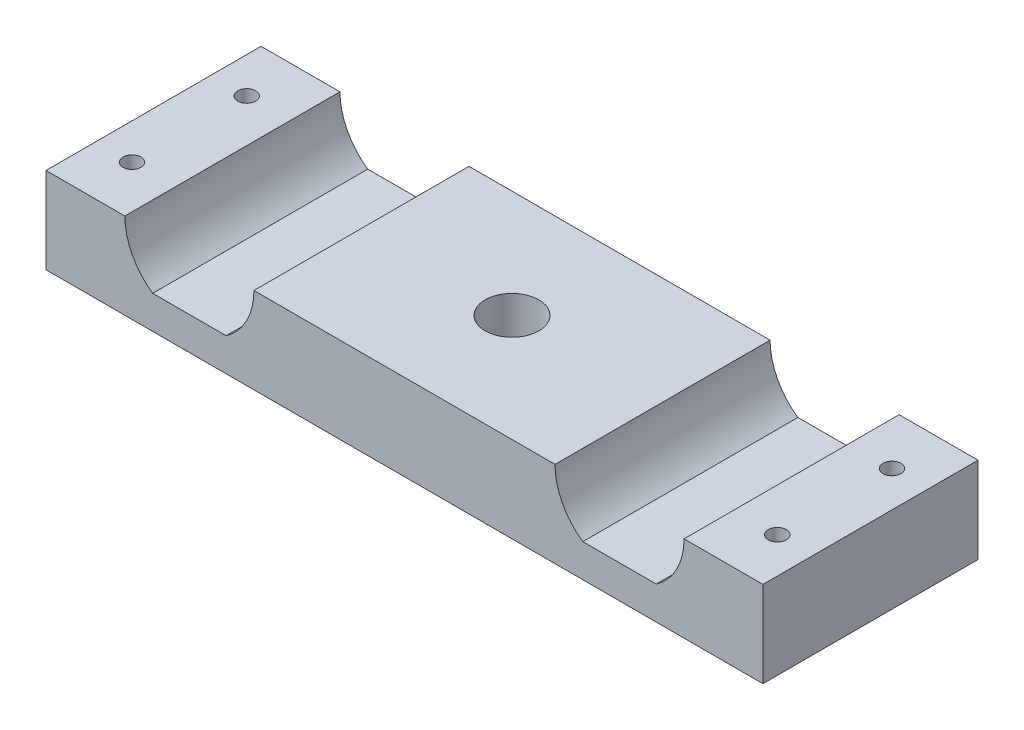
ISO-10303-21;
HEADER;
FILE_DESCRIPTION(('STEP AP214'),'2;1');
FILE_NAME('part.step','',(''),(''),'','','');
FILE_SCHEMA(('AUTOMOTIVE_DESIGN { 1 0 10303 214 1 1 1 1 }'));
ENDSEC;
DATA;
#1=APPLICATION_CONTEXT('core data for automotive mechanical design processes');
#2=APPLICATION_PROTOCOL_DEFINITION('international standard','automotive_design',2000,#1);
#3=PRODUCT_CONTEXT('',#1,'mechanical');
#4=PRODUCT('Part','Part','',(#3));
#5=PRODUCT_RELATED_PRODUCT_CATEGORY('part','',(#4));
#6=PRODUCT_DEFINITION_FORMATION('','',#4);
#7=PRODUCT_DEFINITION_CONTEXT('part definition',#1,'design');
#8=PRODUCT_DEFINITION('design','',#6,#7);
#9=PRODUCT_DEFINITION_SHAPE('','',#8);
#10=(LENGTH_UNIT() NAMED_UNIT(*) SI_UNIT(.MILLI.,.METRE.));
#11=(NAMED_UNIT(*) PLANE_ANGLE_UNIT() SI_UNIT($,.RADIAN.));
#12=(NAMED_UNIT(*) SI_UNIT($,.STERADIAN.) SOLID_ANGLE_UNIT());
#13=UNCERTAINTY_MEASURE_WITH_UNIT(LENGTH_MEASURE(1.E-05),#10,'distance_accuracy_value','');
#14=(GEOMETRIC_REPRESENTATION_CONTEXT(3) GLOBAL_UNCERTAINTY_ASSIGNED_CONTEXT((#13)) GLOBAL_UNIT_ASSIGNED_CONTEXT((#10,
#11,#12)) REPRESENTATION_CONTEXT('',''));
#15=CARTESIAN_POINT('',(0.,0.,0.));
#16=DIRECTION('',(0.,0.,1.));
#17=DIRECTION('',(1.,0.,0.));
#18=AXIS2_PLACEMENT_3D('',#15,#16,#17);
#19=CARTESIAN_POINT('',(63.5,0.,38.1));
#20=DIRECTION('',(-1.,0.,0.));
#21=DIRECTION('',(0.,0.,1.));
#22=AXIS2_PLACEMENT_3D('',#19,#20,#21);
#23=PLANE('',#22);
#24=DIRECTION('',(0.,1.,0.));
#25=VECTOR('',#24,1.);
#26=CARTESIAN_POINT('',(63.5,0.,0.));
#27=LINE('',#26,#25);
#28=CARTESIAN_POINT('',(63.5,0.,0.));
#29=VERTEX_POINT('',#28);
#30=CARTESIAN_POINT('',(63.5,15.24,0.));
#31=VERTEX_POINT('',#30);
#32=EDGE_CURVE('E166',#29,#31,#27,.T.);
#33=ORIENTED_EDGE('',*,*,#32,.T.);
#34=DIRECTION('',(0.,0.,-1.));
#35=VECTOR('',#34,1.);
#36=CARTESIAN_POINT('',(63.5,15.24,38.1));
#37=LINE('',#36,#35);
#38=CARTESIAN_POINT('',(63.5,15.24,38.1));
#39=VERTEX_POINT('',#38);
#40=EDGE_CURVE('E11',#39,#31,#37,.T.);
#41=ORIENTED_EDGE('',*,*,#40,.F.);
#42=DIRECTION('',(0.,1.,0.));
#43=VECTOR('',#42,1.);
#44=CARTESIAN_POINT('',(63.5,0.,38.1));
#45=LINE('',#44,#43);
#46=CARTESIAN_POINT('',(63.5,0.,38.1));
#47=VERTEX_POINT('',#46);
#48=EDGE_CURVE('E201',#47,#39,#45,.T.);
#49=ORIENTED_EDGE('',*,*,#48,.F.);
#50=DIRECTION('',(0.,0.,-1.));
#51=VECTOR('',#50,1.);
#52=CARTESIAN_POINT('',(63.5,0.,38.1));
#53=LINE('',#52,#51);
#54=EDGE_CURVE('E162',#47,#29,#53,.T.);
#55=ORIENTED_EDGE('',*,*,#54,.T.);
#56=EDGE_LOOP('',(#33,#41,#49,#55));
#57=FACE_BOUND('',#56,.T.);
#58=ADVANCED_FACE('F39',(#57),#23,.F.);
#59=CARTESIAN_POINT('',(63.5,15.24,38.1));
#60=DIRECTION('',(0.,-1.,0.));
#61=DIRECTION('',(0.,0.,-1.));
#62=AXIS2_PLACEMENT_3D('',#59,#60,#61);
#63=PLANE('',#62);
#64=CARTESIAN_POINT('',(57.15,15.24,29.21));
#65=DIRECTION('',(0.,1.,0.));
#66=DIRECTION('',(0.,0.,1.));
#67=AXIS2_PLACEMENT_3D('',#64,#65,#66);
#68=CIRCLE('',#67,1.58750000000001);
#69=CARTESIAN_POINT('',(57.15,15.24,30.7975));
#70=VERTEX_POINT('',#69);
#71=EDGE_CURVE('E261',#70,#70,#68,.T.);
#72=ORIENTED_EDGE('',*,*,#71,.F.);
#73=EDGE_LOOP('',(#72));
#74=FACE_BOUND('',#73,.T.);
#75=CARTESIAN_POINT('',(57.15,15.24,8.89));
#76=DIRECTION('',(0.,1.,0.));
#77=DIRECTION('',(0.,0.,1.));
#78=AXIS2_PLACEMENT_3D('',#75,#76,#77);
#79=CIRCLE('',#78,1.58750000000001);
#80=CARTESIAN_POINT('',(57.15,15.24,10.4775));
#81=VERTEX_POINT('',#80);
#82=EDGE_CURVE('E244',#81,#81,#79,.T.);
#83=ORIENTED_EDGE('',*,*,#82,.F.);
#84=EDGE_LOOP('',(#83));
#85=FACE_BOUND('',#84,.T.);
#86=DIRECTION('',(-1.,0.,0.));
#87=VECTOR('',#86,1.);
#88=CARTESIAN_POINT('',(63.5,15.24,0.));
#89=LINE('',#88,#87);
#90=CARTESIAN_POINT('',(49.53,15.24,0.));
#91=VERTEX_POINT('',#90);
#92=EDGE_CURVE('E170',#31,#91,#89,.T.);
#93=ORIENTED_EDGE('',*,*,#92,.T.);
#94=DIRECTION('',(0.,0.,-1.));
#95=VECTOR('',#94,1.);
#96=CARTESIAN_POINT('',(49.53,15.24,38.1));
#97=LINE('',#96,#95);
#98=CARTESIAN_POINT('',(49.53,15.24,38.1));
#99=VERTEX_POINT('',#98);
#100=EDGE_CURVE('E49',#99,#91,#97,.T.);
#101=ORIENTED_EDGE('',*,*,#100,.F.);
#102=DIRECTION('',(-1.,0.,0.));
#103=VECTOR('',#102,1.);
#104=CARTESIAN_POINT('',(63.5,15.24,38.1));
#105=LINE('',#104,#103);
#106=EDGE_CURVE('E113',#39,#99,#105,.T.);
#107=ORIENTED_EDGE('',*,*,#106,.F.);
#108=ORIENTED_EDGE('',*,*,#40,.T.);
#109=EDGE_LOOP('',(#93,#101,#107,#108));
#110=FACE_BOUND('',#109,.T.);
#111=ADVANCED_FACE('F324',(#74,#85,#110),#63,.F.);
#112=CARTESIAN_POINT('',(38.1,15.24,38.1));
#113=DIRECTION('',(0.,0.,-1.));
#114=DIRECTION('',(-1.,0.,0.));
#115=AXIS2_PLACEMENT_3D('',#112,#113,#114);
#116=CYLINDRICAL_SURFACE('',#115,11.43);
#117=CARTESIAN_POINT('',(38.1,15.24,0.));
#118=DIRECTION('',(0.,0.,-1.));
#119=DIRECTION('',(1.,0.,0.));
#120=AXIS2_PLACEMENT_3D('',#117,#118,#119);
#121=CIRCLE('',#120,11.43);
#122=CARTESIAN_POINT('',(44.6055742252318,5.842,0.));
#123=VERTEX_POINT('',#122);
#124=EDGE_CURVE('E174',#91,#123,#121,.T.);
#125=ORIENTED_EDGE('',*,*,#124,.T.);
#126=DIRECTION('',(0.,0.,-1.));
#127=VECTOR('',#126,1.);
#128=CARTESIAN_POINT('',(44.6055742252318,5.842,38.1));
#129=LINE('',#128,#127);
#130=CARTESIAN_POINT('',(44.6055742252318,5.842,38.1));
#131=VERTEX_POINT('',#130);
#132=EDGE_CURVE('E228',#131,#123,#129,.T.);
#133=ORIENTED_EDGE('',*,*,#132,.F.);
#134=CARTESIAN_POINT('',(38.1,15.24,38.1));
#135=DIRECTION('',(0.,0.,-1.));
#136=DIRECTION('',(1.,0.,0.));
#137=AXIS2_PLACEMENT_3D('',#134,#135,#136);
#138=CIRCLE('',#137,11.43);
#139=EDGE_CURVE('E277',#99,#131,#138,.T.);
#140=ORIENTED_EDGE('',*,*,#139,.F.);
#141=ORIENTED_EDGE('',*,*,#100,.T.);
#142=EDGE_LOOP('',(#125,#133,#140,#141));
#143=FACE_BOUND('',#142,.T.);
#144=ADVANCED_FACE('F328',(#143),#116,.F.);
#145=CARTESIAN_POINT('',(44.6055742252318,5.842,38.1));
#146=DIRECTION('',(0.,-1.,0.));
#147=DIRECTION('',(0.,0.,-1.));
#148=AXIS2_PLACEMENT_3D('',#145,#146,#147);
#149=PLANE('',#148);
#150=DIRECTION('',(-1.,0.,0.));
#151=VECTOR('',#150,1.);
#152=CARTESIAN_POINT('',(44.6055742252318,5.842,0.));
#153=LINE('',#152,#151);
#154=CARTESIAN_POINT('',(31.5944257747682,5.842,0.));
#155=VERTEX_POINT('',#154);
#156=EDGE_CURVE('E177',#123,#155,#153,.T.);
#157=ORIENTED_EDGE('',*,*,#156,.T.);
#158=DIRECTION('',(0.,0.,-1.));
#159=VECTOR('',#158,1.);
#160=CARTESIAN_POINT('',(31.5944257747682,5.842,38.1));
#161=LINE('',#160,#159);
#162=CARTESIAN_POINT('',(31.5944257747682,5.842,38.1));
#163=VERTEX_POINT('',#162);
#164=EDGE_CURVE('E224',#163,#155,#161,.T.);
#165=ORIENTED_EDGE('',*,*,#164,.F.);
#166=DIRECTION('',(-1.,0.,0.));
#167=VECTOR('',#166,1.);
#168=CARTESIAN_POINT('',(44.6055742252318,5.842,38.1));
#169=LINE('',#168,#167);
#170=EDGE_CURVE('E280',#131,#163,#169,.T.);
#171=ORIENTED_EDGE('',*,*,#170,.F.);
#172=ORIENTED_EDGE('',*,*,#132,.T.);
#173=EDGE_LOOP('',(#157,#165,#171,#172));
#174=FACE_BOUND('',#173,.T.);
#175=ADVANCED_FACE('F333',(#174),#149,.F.);
#176=CARTESIAN_POINT('',(38.1,15.24,38.1));
#177=DIRECTION('',(0.,0.,-1.));
#178=DIRECTION('',(-1.,0.,0.));
#179=AXIS2_PLACEMENT_3D('',#176,#177,#178);
#180=CYLINDRICAL_SURFACE('',#179,11.43);
#181=CARTESIAN_POINT('',(38.1,15.24,0.));
#182=DIRECTION('',(0.,0.,-1.));
#183=DIRECTION('',(1.,0.,0.));
#184=AXIS2_PLACEMENT_3D('',#181,#182,#183);
#185=CIRCLE('',#184,11.43);
#186=CARTESIAN_POINT('',(26.67,15.24,0.));
#187=VERTEX_POINT('',#186);
#188=EDGE_CURVE('E180',#155,#187,#185,.T.);
#189=ORIENTED_EDGE('',*,*,#188,.T.);
#190=DIRECTION('',(0.,0.,-1.));
#191=VECTOR('',#190,1.);
#192=CARTESIAN_POINT('',(26.67,15.24,38.1));
#193=LINE('',#192,#191);
#194=CARTESIAN_POINT('',(26.67,15.24,38.1));
#195=VERTEX_POINT('',#194);
#196=EDGE_CURVE('E220',#195,#187,#193,.T.);
#197=ORIENTED_EDGE('',*,*,#196,.F.);
#198=CARTESIAN_POINT('',(38.1,15.24,38.1));
#199=DIRECTION('',(0.,0.,-1.));
#200=DIRECTION('',(1.,0.,0.));
#201=AXIS2_PLACEMENT_3D('',#198,#199,#200);
#202=CIRCLE('',#201,11.43);
#203=EDGE_CURVE('E283',#163,#195,#202,.T.);
#204=ORIENTED_EDGE('',*,*,#203,.F.);
#205=ORIENTED_EDGE('',*,*,#164,.T.);
#206=EDGE_LOOP('',(#189,#197,#204,#205));
#207=FACE_BOUND('',#206,.T.);
#208=ADVANCED_FACE('F341',(#207),#180,.F.);
#209=CARTESIAN_POINT('',(26.67,15.24,38.1));
#210=DIRECTION('',(0.,-1.,0.));
#211=DIRECTION('',(0.,0.,-1.));
#212=AXIS2_PLACEMENT_3D('',#209,#210,#211);
#213=PLANE('',#212);
#214=CARTESIAN_POINT('',(0.,15.24,19.05));
#215=DIRECTION('',(0.,1.,0.));
#216=DIRECTION('',(0.,0.,1.));
#217=AXIS2_PLACEMENT_3D('',#214,#215,#216);
#218=CIRCLE('',#217,4.76250000000001);
#219=CARTESIAN_POINT('',(0.,15.24,23.8125));
#220=VERTEX_POINT('',#219);
#221=EDGE_CURVE('E239',#220,#220,#218,.T.);
#222=ORIENTED_EDGE('',*,*,#221,.F.);
#223=EDGE_LOOP('',(#222));
#224=FACE_BOUND('',#223,.T.);
#225=DIRECTION('',(-1.,0.,0.));
#226=VECTOR('',#225,1.);
#227=CARTESIAN_POINT('',(26.67,15.24,0.));
#228=LINE('',#227,#226);
#229=CARTESIAN_POINT('',(-26.67,15.24,0.));
#230=VERTEX_POINT('',#229);
#231=EDGE_CURVE('E183',#187,#230,#228,.T.);
#232=ORIENTED_EDGE('',*,*,#231,.T.);
#233=DIRECTION('',(0.,0.,-1.));
#234=VECTOR('',#233,1.);
#235=CARTESIAN_POINT('',(-26.67,15.24,38.1));
#236=LINE('',#235,#234);
#237=CARTESIAN_POINT('',(-26.67,15.24,38.1));
#238=VERTEX_POINT('',#237);
#239=EDGE_CURVE('E216',#238,#230,#236,.T.);
#240=ORIENTED_EDGE('',*,*,#239,.F.);
#241=DIRECTION('',(-1.,0.,0.));
#242=VECTOR('',#241,1.);
#243=CARTESIAN_POINT('',(26.67,15.24,38.1));
#244=LINE('',#243,#242);
#245=EDGE_CURVE('E286',#195,#238,#244,.T.);
#246=ORIENTED_EDGE('',*,*,#245,.F.);
#247=ORIENTED_EDGE('',*,*,#196,.T.);
#248=EDGE_LOOP('',(#232,#240,#246,#247));
#249=FACE_BOUND('',#248,.T.);
#250=ADVANCED_FACE('F345',(#224,#249),#213,.F.);
#251=CARTESIAN_POINT('',(-38.1,15.24,38.1));
#252=DIRECTION('',(0.,0.,-1.));
#253=DIRECTION('',(-1.,0.,0.));
#254=AXIS2_PLACEMENT_3D('',#251,#252,#253);
#255=CYLINDRICAL_SURFACE('',#254,11.43);
#256=CARTESIAN_POINT('',(-38.1,15.24,0.));
#257=DIRECTION('',(0.,0.,-1.));
#258=DIRECTION('',(-1.,0.,0.));
#259=AXIS2_PLACEMENT_3D('',#256,#257,#258);
#260=CIRCLE('',#259,11.43);
#261=CARTESIAN_POINT('',(-31.5944257747682,5.842,0.));
#262=VERTEX_POINT('',#261);
#263=EDGE_CURVE('E186',#230,#262,#260,.T.);
#264=ORIENTED_EDGE('',*,*,#263,.T.);
#265=DIRECTION('',(0.,0.,-1.));
#266=VECTOR('',#265,1.);
#267=CARTESIAN_POINT('',(-31.5944257747682,5.842,38.1));
#268=LINE('',#267,#266);
#269=CARTESIAN_POINT('',(-31.5944257747682,5.842,38.1));
#270=VERTEX_POINT('',#269);
#271=EDGE_CURVE('E212',#270,#262,#268,.T.);
#272=ORIENTED_EDGE('',*,*,#271,.F.);
#273=CARTESIAN_POINT('',(-38.1,15.24,38.1));
#274=DIRECTION('',(0.,0.,-1.));
#275=DIRECTION('',(-1.,0.,0.));
#276=AXIS2_PLACEMENT_3D('',#273,#274,#275);
#277=CIRCLE('',#276,11.43);
#278=EDGE_CURVE('E289',#238,#270,#277,.T.);
#279=ORIENTED_EDGE('',*,*,#278,.F.);
#280=ORIENTED_EDGE('',*,*,#239,.T.);
#281=EDGE_LOOP('',(#264,#272,#279,#280));
#282=FACE_BOUND('',#281,.T.);
#283=ADVANCED_FACE('F349',(#282),#255,.F.);
#284=CARTESIAN_POINT('',(-44.6055742252318,5.842,38.1));
#285=DIRECTION('',(0.,-1.,0.));
#286=DIRECTION('',(0.,0.,-1.));
#287=AXIS2_PLACEMENT_3D('',#284,#285,#286);
#288=PLANE('',#287);
#289=DIRECTION('',(-1.,0.,0.));
#290=VECTOR('',#289,1.);
#291=CARTESIAN_POINT('',(-44.6055742252318,5.842,0.));
#292=LINE('',#291,#290);
#293=CARTESIAN_POINT('',(-44.6055742252318,5.842,0.));
#294=VERTEX_POINT('',#293);
#295=EDGE_CURVE('E189',#262,#294,#292,.T.);
#296=ORIENTED_EDGE('',*,*,#295,.T.);
#297=DIRECTION('',(0.,0.,-1.));
#298=VECTOR('',#297,1.);
#299=CARTESIAN_POINT('',(-44.6055742252318,5.842,38.1));
#300=LINE('',#299,#298);
#301=CARTESIAN_POINT('',(-44.6055742252318,5.842,38.1));
#302=VERTEX_POINT('',#301);
#303=EDGE_CURVE('E208',#302,#294,#300,.T.);
#304=ORIENTED_EDGE('',*,*,#303,.F.);
#305=DIRECTION('',(-1.,0.,0.));
#306=VECTOR('',#305,1.);
#307=CARTESIAN_POINT('',(-44.6055742252318,5.842,38.1));
#308=LINE('',#307,#306);
#309=EDGE_CURVE('E292',#270,#302,#308,.T.);
#310=ORIENTED_EDGE('',*,*,#309,.F.);
#311=ORIENTED_EDGE('',*,*,#271,.T.);
#312=EDGE_LOOP('',(#296,#304,#310,#311));
#313=FACE_BOUND('',#312,.T.);
#314=ADVANCED_FACE('F300',(#313),#288,.F.);
#315=CARTESIAN_POINT('',(-38.1,15.24,38.1));
#316=DIRECTION('',(0.,0.,-1.));
#317=DIRECTION('',(-1.,0.,0.));
#318=AXIS2_PLACEMENT_3D('',#315,#316,#317);
#319=CYLINDRICAL_SURFACE('',#318,11.43);
#320=CARTESIAN_POINT('',(-38.1,15.24,0.));
#321=DIRECTION('',(0.,0.,-1.));
#322=DIRECTION('',(-1.,0.,0.));
#323=AXIS2_PLACEMENT_3D('',#320,#321,#322);
#324=CIRCLE('',#323,11.43);
#325=CARTESIAN_POINT('',(-49.53,15.24,0.));
#326=VERTEX_POINT('',#325);
#327=EDGE_CURVE('E192',#294,#326,#324,.T.);
#328=ORIENTED_EDGE('',*,*,#327,.T.);
#329=DIRECTION('',(0.,0.,-1.));
#330=VECTOR('',#329,1.);
#331=CARTESIAN_POINT('',(-49.53,15.24,38.1));
#332=LINE('',#331,#330);
#333=CARTESIAN_POINT('',(-49.53,15.24,38.1));
#334=VERTEX_POINT('',#333);
#335=EDGE_CURVE('E155',#334,#326,#332,.T.);
#336=ORIENTED_EDGE('',*,*,#335,.F.);
#337=CARTESIAN_POINT('',(-38.1,15.24,38.1));
#338=DIRECTION('',(0.,0.,-1.));
#339=DIRECTION('',(-1.,0.,0.));
#340=AXIS2_PLACEMENT_3D('',#337,#338,#339);
#341=CIRCLE('',#340,11.43);
#342=EDGE_CURVE('E144',#302,#334,#341,.T.);
#343=ORIENTED_EDGE('',*,*,#342,.F.);
#344=ORIENTED_EDGE('',*,*,#303,.T.);
#345=EDGE_LOOP('',(#328,#336,#343,#344));
#346=FACE_BOUND('',#345,.T.);
#347=ADVANCED_FACE('F304',(#346),#319,.F.);
#348=CARTESIAN_POINT('',(-63.5,15.24,38.1));
#349=DIRECTION('',(0.,-1.,0.));
#350=DIRECTION('',(0.,0.,-1.));
#351=AXIS2_PLACEMENT_3D('',#348,#349,#350);
#352=PLANE('',#351);
#353=CARTESIAN_POINT('',(-57.15,15.24,29.21));
#354=DIRECTION('',(0.,1.,0.));
#355=DIRECTION('',(0.,0.,1.));
#356=AXIS2_PLACEMENT_3D('',#353,#354,#355);
#357=CIRCLE('',#356,1.58750000000001);
#358=CARTESIAN_POINT('',(-57.15,15.24,30.7975));
#359=VERTEX_POINT('',#358);
#360=EDGE_CURVE('E248',#359,#359,#357,.T.);
#361=ORIENTED_EDGE('',*,*,#360,.F.);
#362=EDGE_LOOP('',(#361));
#363=FACE_BOUND('',#362,.T.);
#364=CARTESIAN_POINT('',(-57.15,15.24,8.89));
#365=DIRECTION('',(0.,1.,0.));
#366=DIRECTION('',(0.,0.,1.));
#367=AXIS2_PLACEMENT_3D('',#364,#365,#366);
#368=CIRCLE('',#367,1.58750000000001);
#369=CARTESIAN_POINT('',(-57.15,15.24,10.4775));
#370=VERTEX_POINT('',#369);
#371=EDGE_CURVE('E240',#370,#370,#368,.T.);
#372=ORIENTED_EDGE('',*,*,#371,.F.);
#373=EDGE_LOOP('',(#372));
#374=FACE_BOUND('',#373,.T.);
#375=DIRECTION('',(-1.,0.,0.));
#376=VECTOR('',#375,1.);
#377=CARTESIAN_POINT('',(-63.5,15.24,0.));
#378=LINE('',#377,#376);
#379=CARTESIAN_POINT('',(-63.5,15.24,0.));
#380=VERTEX_POINT('',#379);
#381=EDGE_CURVE('E153',#326,#380,#378,.T.);
#382=ORIENTED_EDGE('',*,*,#381,.T.);
#383=DIRECTION('',(0.,0.,-1.));
#384=VECTOR('',#383,1.);
#385=CARTESIAN_POINT('',(-63.5,15.24,38.1));
#386=LINE('',#385,#384);
#387=CARTESIAN_POINT('',(-63.5,15.24,38.1));
#388=VERTEX_POINT('',#387);
#389=EDGE_CURVE('E150',#388,#380,#386,.T.);
#390=ORIENTED_EDGE('',*,*,#389,.F.);
#391=DIRECTION('',(-1.,0.,0.));
#392=VECTOR('',#391,1.);
#393=CARTESIAN_POINT('',(-63.5,15.24,38.1));
#394=LINE('',#393,#392);
#395=EDGE_CURVE('E138',#334,#388,#394,.T.);
#396=ORIENTED_EDGE('',*,*,#395,.F.);
#397=ORIENTED_EDGE('',*,*,#335,.T.);
#398=EDGE_LOOP('',(#382,#390,#396,#397));
#399=FACE_BOUND('',#398,.T.);
#400=ADVANCED_FACE('F151',(#363,#374,#399),#352,.F.);
#401=CARTESIAN_POINT('',(-63.5,0.,38.1));
#402=DIRECTION('',(1.,0.,0.));
#403=DIRECTION('',(0.,0.,-1.));
#404=AXIS2_PLACEMENT_3D('',#401,#402,#403);
#405=PLANE('',#404);
#406=DIRECTION('',(0.,-1.,0.));
#407=VECTOR('',#406,1.);
#408=CARTESIAN_POINT('',(-63.5,0.,0.));
#409=LINE('',#408,#407);
#410=CARTESIAN_POINT('',(-63.5,0.,0.));
#411=VERTEX_POINT('',#410);
#412=EDGE_CURVE('E99',#380,#411,#409,.T.);
#413=ORIENTED_EDGE('',*,*,#412,.T.);
#414=DIRECTION('',(0.,0.,-1.));
#415=VECTOR('',#414,1.);
#416=CARTESIAN_POINT('',(-63.5,0.,38.1));
#417=LINE('',#416,#415);
#418=CARTESIAN_POINT('',(-63.5,0.,38.1));
#419=VERTEX_POINT('',#418);
#420=EDGE_CURVE('E156',#419,#411,#417,.T.);
#421=ORIENTED_EDGE('',*,*,#420,.F.);
#422=DIRECTION('',(0.,-1.,0.));
#423=VECTOR('',#422,1.);
#424=CARTESIAN_POINT('',(-63.5,0.,38.1));
#425=LINE('',#424,#423);
#426=EDGE_CURVE('E142',#388,#419,#425,.T.);
#427=ORIENTED_EDGE('',*,*,#426,.F.);
#428=ORIENTED_EDGE('',*,*,#389,.T.);
#429=EDGE_LOOP('',(#413,#421,#427,#428));
#430=FACE_BOUND('',#429,.T.);
#431=ADVANCED_FACE('F158',(#430),#405,.F.);
#432=CARTESIAN_POINT('',(-63.5,0.,38.1));
#433=DIRECTION('',(0.,1.,0.));
#434=DIRECTION('',(0.,0.,1.));
#435=AXIS2_PLACEMENT_3D('',#432,#433,#434);
#436=PLANE('',#435);
#437=CARTESIAN_POINT('',(57.15,0.,29.21));
#438=DIRECTION('',(0.,1.,0.));
#439=DIRECTION('',(0.,0.,1.));
#440=AXIS2_PLACEMENT_3D('',#437,#438,#439);
#441=CIRCLE('',#440,1.58750000000001);
#442=CARTESIAN_POINT('',(57.15,0.,30.7975));
#443=VERTEX_POINT('',#442);
#444=EDGE_CURVE('E42',#443,#443,#441,.T.);
#445=ORIENTED_EDGE('',*,*,#444,.T.);
#446=EDGE_LOOP('',(#445));
#447=FACE_BOUND('',#446,.T.);
#448=CARTESIAN_POINT('',(-57.15,0.,29.21));
#449=DIRECTION('',(0.,1.,0.));
#450=DIRECTION('',(0.,0.,1.));
#451=AXIS2_PLACEMENT_3D('',#448,#449,#450);
#452=CIRCLE('',#451,1.58750000000001);
#453=CARTESIAN_POINT('',(-57.15,0.,30.7975));
#454=VERTEX_POINT('',#453);
#455=EDGE_CURVE('E245',#454,#454,#452,.T.);
#456=ORIENTED_EDGE('',*,*,#455,.T.);
#457=EDGE_LOOP('',(#456));
#458=FACE_BOUND('',#457,.T.);
#459=CARTESIAN_POINT('',(57.15,0.,8.89));
#460=DIRECTION('',(0.,1.,0.));
#461=DIRECTION('',(0.,0.,1.));
#462=AXIS2_PLACEMENT_3D('',#459,#460,#461);
#463=CIRCLE('',#462,1.58750000000001);
#464=CARTESIAN_POINT('',(57.15,0.,10.4775));
#465=VERTEX_POINT('',#464);
#466=EDGE_CURVE('E241',#465,#465,#463,.T.);
#467=ORIENTED_EDGE('',*,*,#466,.T.);
#468=EDGE_LOOP('',(#467));
#469=FACE_BOUND('',#468,.T.);
#470=CARTESIAN_POINT('',(-57.15,0.,8.89));
#471=DIRECTION('',(0.,1.,0.));
#472=DIRECTION('',(0.,0.,1.));
#473=AXIS2_PLACEMENT_3D('',#470,#471,#472);
#474=CIRCLE('',#473,1.58750000000001);
#475=CARTESIAN_POINT('',(-57.15,0.,10.4775));
#476=VERTEX_POINT('',#475);
#477=EDGE_CURVE('E235',#476,#476,#474,.T.);
#478=ORIENTED_EDGE('',*,*,#477,.T.);
#479=EDGE_LOOP('',(#478));
#480=FACE_BOUND('',#479,.T.);
#481=CARTESIAN_POINT('',(0.,0.,19.05));
#482=DIRECTION('',(0.,1.,0.));
#483=DIRECTION('',(0.,0.,1.));
#484=AXIS2_PLACEMENT_3D('',#481,#482,#483);
#485=CIRCLE('',#484,4.76250000000001);
#486=CARTESIAN_POINT('',(0.,0.,23.8125));
#487=VERTEX_POINT('',#486);
#488=EDGE_CURVE('E171',#487,#487,#485,.T.);
#489=ORIENTED_EDGE('',*,*,#488,.T.);
#490=EDGE_LOOP('',(#489));
#491=FACE_BOUND('',#490,.T.);
#492=DIRECTION('',(1.,0.,0.));
#493=VECTOR('',#492,1.);
#494=CARTESIAN_POINT('',(-63.5,0.,0.));
#495=LINE('',#494,#493);
#496=EDGE_CURVE('E105',#411,#29,#495,.T.);
#497=ORIENTED_EDGE('',*,*,#496,.T.);
#498=ORIENTED_EDGE('',*,*,#54,.F.);
#499=DIRECTION('',(1.,0.,0.));
#500=VECTOR('',#499,1.);
#501=CARTESIAN_POINT('',(-63.5,0.,38.1));
#502=LINE('',#501,#500);
#503=EDGE_CURVE('E58',#419,#47,#502,.T.);
#504=ORIENTED_EDGE('',*,*,#503,.F.);
#505=ORIENTED_EDGE('',*,*,#420,.T.);
#506=EDGE_LOOP('',(#497,#498,#504,#505));
#507=FACE_BOUND('',#506,.T.);
#508=ADVANCED_FACE('F312',(#447,#458,#469,#480,#491,#507),#436,.F.);
#509=CARTESIAN_POINT('',(38.1,15.24,38.1));
#510=DIRECTION('',(0.,0.,1.));
#511=DIRECTION('',(1.,0.,0.));
#512=AXIS2_PLACEMENT_3D('',#509,#510,#511);
#513=PLANE('',#512);
#514=ORIENTED_EDGE('',*,*,#48,.T.);
#515=ORIENTED_EDGE('',*,*,#106,.T.);
#516=ORIENTED_EDGE('',*,*,#139,.T.);
#517=ORIENTED_EDGE('',*,*,#170,.T.);
#518=ORIENTED_EDGE('',*,*,#203,.T.);
#519=ORIENTED_EDGE('',*,*,#245,.T.);
#520=ORIENTED_EDGE('',*,*,#278,.T.);
#521=ORIENTED_EDGE('',*,*,#309,.T.);
#522=ORIENTED_EDGE('',*,*,#342,.T.);
#523=ORIENTED_EDGE('',*,*,#395,.T.);
#524=ORIENTED_EDGE('',*,*,#426,.T.);
#525=ORIENTED_EDGE('',*,*,#503,.T.);
#526=EDGE_LOOP('',(#514,#515,#516,#517,#518,#519,#520,#521,#522,#523,#524,#525));
#527=FACE_BOUND('',#526,.T.);
#528=ADVANCED_FACE('F140',(#527),#513,.T.);
#529=CARTESIAN_POINT('',(38.1,15.24,0.));
#530=DIRECTION('',(0.,0.,1.));
#531=DIRECTION('',(1.,0.,0.));
#532=AXIS2_PLACEMENT_3D('',#529,#530,#531);
#533=PLANE('',#532);
#534=ORIENTED_EDGE('',*,*,#32,.F.);
#535=ORIENTED_EDGE('',*,*,#496,.F.);
#536=ORIENTED_EDGE('',*,*,#412,.F.);
#537=ORIENTED_EDGE('',*,*,#381,.F.);
#538=ORIENTED_EDGE('',*,*,#327,.F.);
#539=ORIENTED_EDGE('',*,*,#295,.F.);
#540=ORIENTED_EDGE('',*,*,#263,.F.);
#541=ORIENTED_EDGE('',*,*,#231,.F.);
#542=ORIENTED_EDGE('',*,*,#188,.F.);
#543=ORIENTED_EDGE('',*,*,#156,.F.);
#544=ORIENTED_EDGE('',*,*,#124,.F.);
#545=ORIENTED_EDGE('',*,*,#92,.F.);
#546=EDGE_LOOP('',(#534,#535,#536,#537,#538,#539,#540,#541,#542,#543,#544,#545));
#547=FACE_BOUND('',#546,.T.);
#548=ADVANCED_FACE('F307',(#547),#533,.F.);
#549=CARTESIAN_POINT('',(0.,15.24,19.05));
#550=DIRECTION('',(0.,1.,0.));
#551=DIRECTION('',(0.,0.,1.));
#552=AXIS2_PLACEMENT_3D('',#549,#550,#551);
#553=CYLINDRICAL_SURFACE('',#552,4.76250000000001);
#554=ORIENTED_EDGE('',*,*,#221,.T.);
#555=EDGE_LOOP('',(#554));
#556=FACE_BOUND('',#555,.T.);
#557=ORIENTED_EDGE('',*,*,#488,.F.);
#558=EDGE_LOOP('',(#557));
#559=FACE_BOUND('',#558,.T.);
#560=ADVANCED_FACE('F369',(#556,#559),#553,.F.);
#561=CARTESIAN_POINT('',(-57.15,15.24,8.89));
#562=DIRECTION('',(0.,1.,0.));
#563=DIRECTION('',(0.,0.,1.));
#564=AXIS2_PLACEMENT_3D('',#561,#562,#563);
#565=CYLINDRICAL_SURFACE('',#564,1.58750000000001);
#566=ORIENTED_EDGE('',*,*,#371,.T.);
#567=EDGE_LOOP('',(#566));
#568=FACE_BOUND('',#567,.T.);
#569=ORIENTED_EDGE('',*,*,#477,.F.);
#570=EDGE_LOOP('',(#569));
#571=FACE_BOUND('',#570,.T.);
#572=ADVANCED_FACE('F365',(#568,#571),#565,.F.);
#573=CARTESIAN_POINT('',(57.15,15.24,8.89));
#574=DIRECTION('',(0.,1.,0.));
#575=DIRECTION('',(0.,0.,1.));
#576=AXIS2_PLACEMENT_3D('',#573,#574,#575);
#577=CYLINDRICAL_SURFACE('',#576,1.58750000000001);
#578=ORIENTED_EDGE('',*,*,#82,.T.);
#579=EDGE_LOOP('',(#578));
#580=FACE_BOUND('',#579,.T.);
#581=ORIENTED_EDGE('',*,*,#466,.F.);
#582=EDGE_LOOP('',(#581));
#583=FACE_BOUND('',#582,.T.);
#584=ADVANCED_FACE('F368',(#580,#583),#577,.F.);
#585=CARTESIAN_POINT('',(-57.15,15.24,29.21));
#586=DIRECTION('',(0.,1.,0.));
#587=DIRECTION('',(0.,0.,1.));
#588=AXIS2_PLACEMENT_3D('',#585,#586,#587);
#589=CYLINDRICAL_SURFACE('',#588,1.58750000000001);
#590=ORIENTED_EDGE('',*,*,#360,.T.);
#591=EDGE_LOOP('',(#590));
#592=FACE_BOUND('',#591,.T.);
#593=ORIENTED_EDGE('',*,*,#455,.F.);
#594=EDGE_LOOP('',(#593));
#595=FACE_BOUND('',#594,.T.);
#596=ADVANCED_FACE('F385',(#592,#595),#589,.F.);
#597=CARTESIAN_POINT('',(57.15,15.24,29.21));
#598=DIRECTION('',(0.,1.,0.));
#599=DIRECTION('',(0.,0.,1.));
#600=AXIS2_PLACEMENT_3D('',#597,#598,#599);
#601=CYLINDRICAL_SURFACE('',#600,1.58750000000001);
#602=ORIENTED_EDGE('',*,*,#71,.T.);
#603=EDGE_LOOP('',(#602));
#604=FACE_BOUND('',#603,.T.);
#605=ORIENTED_EDGE('',*,*,#444,.F.);
#606=EDGE_LOOP('',(#605));
#607=FACE_BOUND('',#606,.T.);
#608=ADVANCED_FACE('F389',(#604,#607),#601,.F.);
#609=CLOSED_SHELL('',(#58,#111,#144,#175,#208,#250,#283,#314,#347,#400,#431,#508,#528,#548,#560,
#572,#584,#596,#608));
#610=MANIFOLD_SOLID_BREP('B2',#609);
#611=ADVANCED_BREP_SHAPE_REPRESENTATION('',(#18,#610),#14);
#612=SHAPE_DEFINITION_REPRESENTATION(#9,#611);
ENDSEC;
END-ISO-10303-21;
